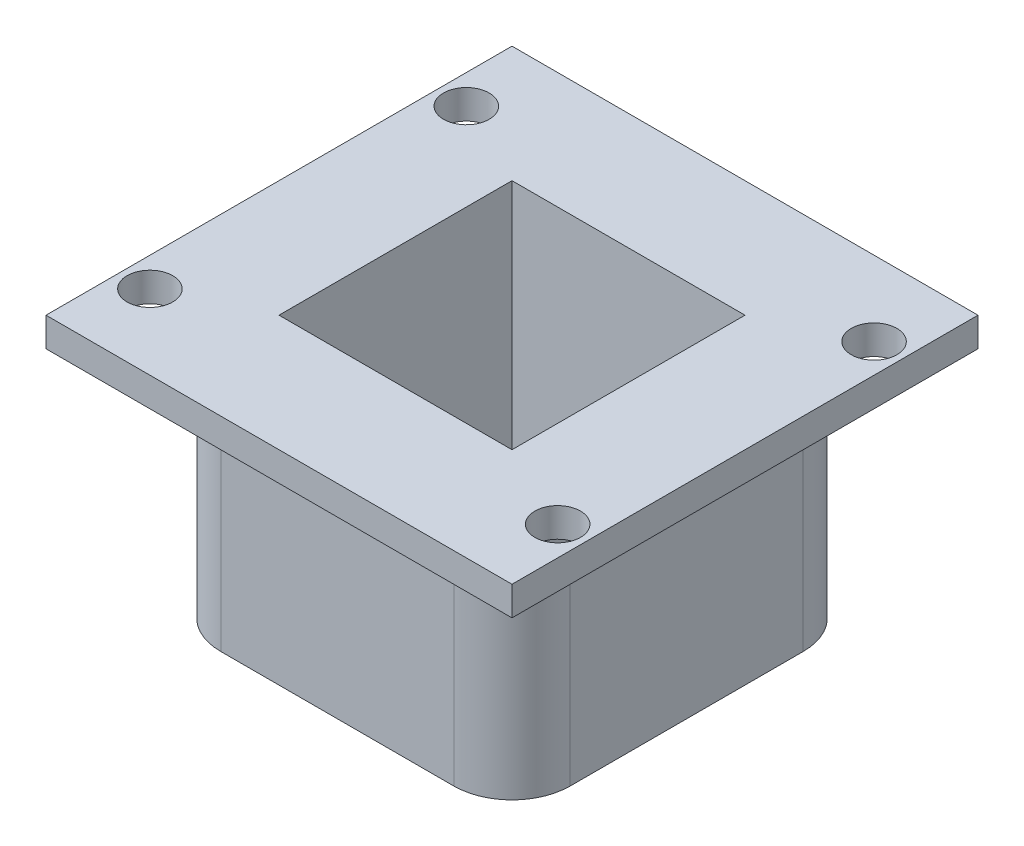
ISO-10303-21;
HEADER;
FILE_DESCRIPTION(('STEP AP214'),'2;1');
FILE_NAME('part.step','',(''),(''),'','','');
FILE_SCHEMA(('AUTOMOTIVE_DESIGN { 1 0 10303 214 1 1 1 1 }'));
ENDSEC;
DATA;
#1=APPLICATION_CONTEXT('core data for automotive mechanical design processes');
#2=APPLICATION_PROTOCOL_DEFINITION('international standard','automotive_design',2000,#1);
#3=PRODUCT_CONTEXT('',#1,'mechanical');
#4=PRODUCT('Part','Part','',(#3));
#5=PRODUCT_RELATED_PRODUCT_CATEGORY('part','',(#4));
#6=PRODUCT_DEFINITION_FORMATION('','',#4);
#7=PRODUCT_DEFINITION_CONTEXT('part definition',#1,'design');
#8=PRODUCT_DEFINITION('design','',#6,#7);
#9=PRODUCT_DEFINITION_SHAPE('','',#8);
#10=(LENGTH_UNIT() NAMED_UNIT(*) SI_UNIT(.MILLI.,.METRE.));
#11=(NAMED_UNIT(*) PLANE_ANGLE_UNIT() SI_UNIT($,.RADIAN.));
#12=(NAMED_UNIT(*) SI_UNIT($,.STERADIAN.) SOLID_ANGLE_UNIT());
#13=UNCERTAINTY_MEASURE_WITH_UNIT(LENGTH_MEASURE(1.E-05),#10,'distance_accuracy_value','');
#14=(GEOMETRIC_REPRESENTATION_CONTEXT(3) GLOBAL_UNCERTAINTY_ASSIGNED_CONTEXT((#13)) GLOBAL_UNIT_ASSIGNED_CONTEXT((#10,
#11,#12)) REPRESENTATION_CONTEXT('',''));
#15=CARTESIAN_POINT('',(0.,0.,0.));
#16=DIRECTION('',(0.,0.,1.));
#17=DIRECTION('',(1.,0.,0.));
#18=AXIS2_PLACEMENT_3D('',#15,#16,#17);
#19=CARTESIAN_POINT('',(0.,0.,0.));
#20=DIRECTION('',(0.,1.,0.));
#21=DIRECTION('',(0.,0.,1.));
#22=AXIS2_PLACEMENT_3D('',#19,#20,#21);
#23=PLANE('',#22);
#24=CARTESIAN_POINT('',(-22.225,0.,17.2466));
#25=DIRECTION('',(0.,1.,0.));
#26=DIRECTION('',(0.,0.,1.));
#27=AXIS2_PLACEMENT_3D('',#24,#25,#26);
#28=CIRCLE('',#27,2.4892);
#29=CARTESIAN_POINT('',(-22.225,0.,19.7358));
#30=VERTEX_POINT('',#29);
#31=EDGE_CURVE('E252',#30,#30,#28,.F.);
#32=ORIENTED_EDGE('',*,*,#31,.F.);
#33=EDGE_LOOP('',(#32));
#34=FACE_BOUND('',#33,.T.);
#35=CARTESIAN_POINT('',(22.225,0.,17.2466));
#36=DIRECTION('',(0.,1.,0.));
#37=DIRECTION('',(0.,0.,1.));
#38=AXIS2_PLACEMENT_3D('',#35,#36,#37);
#39=CIRCLE('',#38,2.4892);
#40=CARTESIAN_POINT('',(22.225,0.,19.7358));
#41=VERTEX_POINT('',#40);
#42=EDGE_CURVE('E290',#41,#41,#39,.T.);
#43=ORIENTED_EDGE('',*,*,#42,.T.);
#44=EDGE_LOOP('',(#43));
#45=FACE_BOUND('',#44,.T.);
#46=DIRECTION('',(1.,0.,0.));
#47=VECTOR('',#46,1.);
#48=CARTESIAN_POINT('',(0.,0.,25.4));
#49=LINE('',#48,#47);
#50=CARTESIAN_POINT('',(-25.4,0.,25.4));
#51=VERTEX_POINT('',#50);
#52=CARTESIAN_POINT('',(25.4,0.,25.4));
#53=VERTEX_POINT('',#52);
#54=EDGE_CURVE('E278',#51,#53,#49,.T.);
#55=ORIENTED_EDGE('',*,*,#54,.F.);
#56=DIRECTION('',(0.,0.,-1.));
#57=VECTOR('',#56,1.);
#58=CARTESIAN_POINT('',(-25.4,0.,0.));
#59=LINE('',#58,#57);
#60=CARTESIAN_POINT('',(-25.4,0.,-25.4));
#61=VERTEX_POINT('',#60);
#62=EDGE_CURVE('E287',#51,#61,#59,.T.);
#63=ORIENTED_EDGE('',*,*,#62,.T.);
#64=DIRECTION('',(1.,0.,0.));
#65=VECTOR('',#64,1.);
#66=CARTESIAN_POINT('',(0.,0.,-25.4));
#67=LINE('',#66,#65);
#68=CARTESIAN_POINT('',(25.4,0.,-25.4));
#69=VERTEX_POINT('',#68);
#70=EDGE_CURVE('E284',#61,#69,#67,.T.);
#71=ORIENTED_EDGE('',*,*,#70,.T.);
#72=DIRECTION('',(0.,0.,-1.));
#73=VECTOR('',#72,1.);
#74=CARTESIAN_POINT('',(25.4,0.,0.));
#75=LINE('',#74,#73);
#76=EDGE_CURVE('E281',#53,#69,#75,.T.);
#77=ORIENTED_EDGE('',*,*,#76,.F.);
#78=EDGE_LOOP('',(#55,#63,#71,#77));
#79=FACE_BOUND('',#78,.T.);
#80=CARTESIAN_POINT('',(-22.225,0.,-17.2466));
#81=DIRECTION('',(0.,1.,0.));
#82=DIRECTION('',(0.,0.,1.));
#83=AXIS2_PLACEMENT_3D('',#80,#81,#82);
#84=CIRCLE('',#83,2.4892);
#85=CARTESIAN_POINT('',(-22.225,0.,-14.7574));
#86=VERTEX_POINT('',#85);
#87=EDGE_CURVE('E275',#86,#86,#84,.T.);
#88=ORIENTED_EDGE('',*,*,#87,.T.);
#89=EDGE_LOOP('',(#88));
#90=FACE_BOUND('',#89,.T.);
#91=CARTESIAN_POINT('',(22.225,0.,-17.2466));
#92=DIRECTION('',(0.,1.,0.));
#93=DIRECTION('',(0.,0.,1.));
#94=AXIS2_PLACEMENT_3D('',#91,#92,#93);
#95=CIRCLE('',#94,2.4892);
#96=CARTESIAN_POINT('',(22.225,0.,-14.7574));
#97=VERTEX_POINT('',#96);
#98=EDGE_CURVE('E230',#97,#97,#95,.F.);
#99=ORIENTED_EDGE('',*,*,#98,.F.);
#100=EDGE_LOOP('',(#99));
#101=FACE_BOUND('',#100,.T.);
#102=CARTESIAN_POINT('',(-12.6999999999987,0.,12.7));
#103=DIRECTION('',(0.,1.,0.));
#104=DIRECTION('',(0.,0.,1.));
#105=AXIS2_PLACEMENT_3D('',#102,#103,#104);
#106=CIRCLE('',#105,6.35);
#107=CARTESIAN_POINT('',(-12.6999999999987,0.,19.05));
#108=VERTEX_POINT('',#107);
#109=CARTESIAN_POINT('',(-19.05,0.,12.7));
#110=VERTEX_POINT('',#109);
#111=EDGE_CURVE('E185',#108,#110,#106,.F.);
#112=ORIENTED_EDGE('',*,*,#111,.F.);
#113=DIRECTION('',(1.,0.,0.));
#114=VECTOR('',#113,1.);
#115=CARTESIAN_POINT('',(0.,0.,19.05));
#116=LINE('',#115,#114);
#117=CARTESIAN_POINT('',(12.7000000000013,0.,19.05));
#118=VERTEX_POINT('',#117);
#119=EDGE_CURVE('E212',#108,#118,#116,.T.);
#120=ORIENTED_EDGE('',*,*,#119,.T.);
#121=CARTESIAN_POINT('',(12.7000000000013,0.,12.6999999999987));
#122=DIRECTION('',(0.,1.,0.));
#123=DIRECTION('',(0.,0.,1.));
#124=AXIS2_PLACEMENT_3D('',#121,#122,#123);
#125=CIRCLE('',#124,6.35);
#126=CARTESIAN_POINT('',(19.05,0.,12.6999999999987));
#127=VERTEX_POINT('',#126);
#128=EDGE_CURVE('E215',#127,#118,#125,.F.);
#129=ORIENTED_EDGE('',*,*,#128,.F.);
#130=DIRECTION('',(0.,0.,-1.));
#131=VECTOR('',#130,1.);
#132=CARTESIAN_POINT('',(19.05,0.,0.));
#133=LINE('',#132,#131);
#134=CARTESIAN_POINT('',(19.05,0.,-12.7000000000013));
#135=VERTEX_POINT('',#134);
#136=EDGE_CURVE('E217',#127,#135,#133,.T.);
#137=ORIENTED_EDGE('',*,*,#136,.T.);
#138=CARTESIAN_POINT('',(12.7,0.,-12.7000000000013));
#139=DIRECTION('',(0.,1.,0.));
#140=DIRECTION('',(0.,0.,1.));
#141=AXIS2_PLACEMENT_3D('',#138,#139,#140);
#142=CIRCLE('',#141,6.35);
#143=CARTESIAN_POINT('',(12.7,0.,-19.05));
#144=VERTEX_POINT('',#143);
#145=EDGE_CURVE('E220',#144,#135,#142,.F.);
#146=ORIENTED_EDGE('',*,*,#145,.F.);
#147=DIRECTION('',(1.,0.,0.));
#148=VECTOR('',#147,1.);
#149=CARTESIAN_POINT('',(0.,0.,-19.05));
#150=LINE('',#149,#148);
#151=CARTESIAN_POINT('',(-12.7,0.,-19.05));
#152=VERTEX_POINT('',#151);
#153=EDGE_CURVE('E223',#152,#144,#150,.T.);
#154=ORIENTED_EDGE('',*,*,#153,.F.);
#155=CARTESIAN_POINT('',(-12.7,0.,-12.7));
#156=DIRECTION('',(0.,1.,0.));
#157=DIRECTION('',(0.,0.,1.));
#158=AXIS2_PLACEMENT_3D('',#155,#156,#157);
#159=CIRCLE('',#158,6.35);
#160=CARTESIAN_POINT('',(-19.05,0.,-12.7));
#161=VERTEX_POINT('',#160);
#162=EDGE_CURVE('E225',#161,#152,#159,.F.);
#163=ORIENTED_EDGE('',*,*,#162,.F.);
#164=DIRECTION('',(0.,0.,-1.));
#165=VECTOR('',#164,1.);
#166=CARTESIAN_POINT('',(-19.05,0.,0.));
#167=LINE('',#166,#165);
#168=EDGE_CURVE('E193',#110,#161,#167,.T.);
#169=ORIENTED_EDGE('',*,*,#168,.F.);
#170=EDGE_LOOP('',(#112,#120,#129,#137,#146,#154,#163,#169));
#171=FACE_BOUND('',#170,.T.);
#172=ADVANCED_FACE('F39',(#34,#45,#79,#90,#101,#171),#23,.F.);
#173=CARTESIAN_POINT('',(0.,3.175,25.4));
#174=DIRECTION('',(0.,0.,-1.));
#175=DIRECTION('',(-1.,0.,0.));
#176=AXIS2_PLACEMENT_3D('',#173,#174,#175);
#177=PLANE('',#176);
#178=ORIENTED_EDGE('',*,*,#54,.T.);
#179=DIRECTION('',(0.,-1.,0.));
#180=VECTOR('',#179,1.);
#181=CARTESIAN_POINT('',(25.4,3.175,25.4));
#182=LINE('',#181,#180);
#183=CARTESIAN_POINT('',(25.4,3.175,25.4));
#184=VERTEX_POINT('',#183);
#185=EDGE_CURVE('E11',#184,#53,#182,.T.);
#186=ORIENTED_EDGE('',*,*,#185,.F.);
#187=DIRECTION('',(1.,0.,0.));
#188=VECTOR('',#187,1.);
#189=CARTESIAN_POINT('',(0.,3.175,25.4));
#190=LINE('',#189,#188);
#191=CARTESIAN_POINT('',(-25.4,3.175,25.4));
#192=VERTEX_POINT('',#191);
#193=EDGE_CURVE('E255',#192,#184,#190,.T.);
#194=ORIENTED_EDGE('',*,*,#193,.F.);
#195=DIRECTION('',(0.,-1.,0.));
#196=VECTOR('',#195,1.);
#197=CARTESIAN_POINT('',(-25.4,3.175,25.4));
#198=LINE('',#197,#196);
#199=EDGE_CURVE('E272',#192,#51,#198,.T.);
#200=ORIENTED_EDGE('',*,*,#199,.T.);
#201=EDGE_LOOP('',(#178,#186,#194,#200));
#202=FACE_BOUND('',#201,.T.);
#203=ADVANCED_FACE('F317',(#202),#177,.F.);
#204=CARTESIAN_POINT('',(25.4,3.175,0.));
#205=DIRECTION('',(-1.,0.,0.));
#206=DIRECTION('',(0.,0.,1.));
#207=AXIS2_PLACEMENT_3D('',#204,#205,#206);
#208=PLANE('',#207);
#209=ORIENTED_EDGE('',*,*,#76,.T.);
#210=DIRECTION('',(0.,-1.,0.));
#211=VECTOR('',#210,1.);
#212=CARTESIAN_POINT('',(25.4,3.175,-25.4));
#213=LINE('',#212,#211);
#214=CARTESIAN_POINT('',(25.4,3.175,-25.4));
#215=VERTEX_POINT('',#214);
#216=EDGE_CURVE('E47',#215,#69,#213,.T.);
#217=ORIENTED_EDGE('',*,*,#216,.F.);
#218=DIRECTION('',(0.,0.,-1.));
#219=VECTOR('',#218,1.);
#220=CARTESIAN_POINT('',(25.4,3.175,0.));
#221=LINE('',#220,#219);
#222=EDGE_CURVE('E258',#184,#215,#221,.T.);
#223=ORIENTED_EDGE('',*,*,#222,.F.);
#224=ORIENTED_EDGE('',*,*,#185,.T.);
#225=EDGE_LOOP('',(#209,#217,#223,#224));
#226=FACE_BOUND('',#225,.T.);
#227=ADVANCED_FACE('F303',(#226),#208,.F.);
#228=CARTESIAN_POINT('',(0.,3.175,-25.4));
#229=DIRECTION('',(0.,0.,-1.));
#230=DIRECTION('',(-1.,0.,0.));
#231=AXIS2_PLACEMENT_3D('',#228,#229,#230);
#232=PLANE('',#231);
#233=ORIENTED_EDGE('',*,*,#70,.F.);
#234=DIRECTION('',(0.,-1.,0.));
#235=VECTOR('',#234,1.);
#236=CARTESIAN_POINT('',(-25.4,3.175,-25.4));
#237=LINE('',#236,#235);
#238=CARTESIAN_POINT('',(-25.4,3.175,-25.4));
#239=VERTEX_POINT('',#238);
#240=EDGE_CURVE('E296',#239,#61,#237,.T.);
#241=ORIENTED_EDGE('',*,*,#240,.F.);
#242=DIRECTION('',(1.,0.,0.));
#243=VECTOR('',#242,1.);
#244=CARTESIAN_POINT('',(0.,3.175,-25.4));
#245=LINE('',#244,#243);
#246=EDGE_CURVE('E260',#239,#215,#245,.T.);
#247=ORIENTED_EDGE('',*,*,#246,.T.);
#248=ORIENTED_EDGE('',*,*,#216,.T.);
#249=EDGE_LOOP('',(#233,#241,#247,#248));
#250=FACE_BOUND('',#249,.T.);
#251=ADVANCED_FACE('F300',(#250),#232,.T.);
#252=CARTESIAN_POINT('',(22.225,3.175,17.2466));
#253=DIRECTION('',(0.,-1.,0.));
#254=DIRECTION('',(0.,0.,-1.));
#255=AXIS2_PLACEMENT_3D('',#252,#253,#254);
#256=CYLINDRICAL_SURFACE('',#255,2.4892);
#257=CARTESIAN_POINT('',(22.225,3.175,17.2466));
#258=DIRECTION('',(0.,1.,0.));
#259=DIRECTION('',(0.,0.,1.));
#260=AXIS2_PLACEMENT_3D('',#257,#258,#259);
#261=CIRCLE('',#260,2.4892);
#262=CARTESIAN_POINT('',(22.225,3.175,19.7358));
#263=VERTEX_POINT('',#262);
#264=EDGE_CURVE('E266',#263,#263,#261,.T.);
#265=ORIENTED_EDGE('',*,*,#264,.T.);
#266=EDGE_LOOP('',(#265));
#267=FACE_BOUND('',#266,.T.);
#268=ORIENTED_EDGE('',*,*,#42,.F.);
#269=EDGE_LOOP('',(#268));
#270=FACE_BOUND('',#269,.T.);
#271=ADVANCED_FACE('F337',(#267,#270),#256,.F.);
#272=CARTESIAN_POINT('',(-25.4,3.175,0.));
#273=DIRECTION('',(-1.,0.,0.));
#274=DIRECTION('',(0.,0.,1.));
#275=AXIS2_PLACEMENT_3D('',#272,#273,#274);
#276=PLANE('',#275);
#277=ORIENTED_EDGE('',*,*,#62,.F.);
#278=ORIENTED_EDGE('',*,*,#199,.F.);
#279=DIRECTION('',(0.,0.,-1.));
#280=VECTOR('',#279,1.);
#281=CARTESIAN_POINT('',(-25.4,3.175,0.));
#282=LINE('',#281,#280);
#283=EDGE_CURVE('E263',#192,#239,#282,.T.);
#284=ORIENTED_EDGE('',*,*,#283,.T.);
#285=ORIENTED_EDGE('',*,*,#240,.T.);
#286=EDGE_LOOP('',(#277,#278,#284,#285));
#287=FACE_BOUND('',#286,.T.);
#288=ADVANCED_FACE('F310',(#287),#276,.T.);
#289=CARTESIAN_POINT('',(-22.225,3.175,-17.2466));
#290=DIRECTION('',(0.,-1.,0.));
#291=DIRECTION('',(0.,0.,-1.));
#292=AXIS2_PLACEMENT_3D('',#289,#290,#291);
#293=CYLINDRICAL_SURFACE('',#292,2.4892);
#294=CARTESIAN_POINT('',(-22.225,3.175,-17.2466));
#295=DIRECTION('',(0.,1.,0.));
#296=DIRECTION('',(0.,0.,1.));
#297=AXIS2_PLACEMENT_3D('',#294,#295,#296);
#298=CIRCLE('',#297,2.4892);
#299=CARTESIAN_POINT('',(-22.225,3.175,-14.7574));
#300=VERTEX_POINT('',#299);
#301=EDGE_CURVE('E251',#300,#300,#298,.T.);
#302=ORIENTED_EDGE('',*,*,#301,.T.);
#303=EDGE_LOOP('',(#302));
#304=FACE_BOUND('',#303,.T.);
#305=ORIENTED_EDGE('',*,*,#87,.F.);
#306=EDGE_LOOP('',(#305));
#307=FACE_BOUND('',#306,.T.);
#308=ADVANCED_FACE('F328',(#304,#307),#293,.F.);
#309=CARTESIAN_POINT('',(22.225,3.175,-17.2466));
#310=DIRECTION('',(0.,-1.,0.));
#311=DIRECTION('',(0.,0.,-1.));
#312=AXIS2_PLACEMENT_3D('',#309,#310,#311);
#313=CYLINDRICAL_SURFACE('',#312,2.4892);
#314=CARTESIAN_POINT('',(22.225,3.175,-17.2466));
#315=DIRECTION('',(0.,1.,0.));
#316=DIRECTION('',(0.,0.,1.));
#317=AXIS2_PLACEMENT_3D('',#314,#315,#316);
#318=CIRCLE('',#317,2.4892);
#319=CARTESIAN_POINT('',(22.225,3.175,-14.7574));
#320=VERTEX_POINT('',#319);
#321=EDGE_CURVE('E248',#320,#320,#318,.F.);
#322=ORIENTED_EDGE('',*,*,#321,.F.);
#323=EDGE_LOOP('',(#322));
#324=FACE_BOUND('',#323,.T.);
#325=ORIENTED_EDGE('',*,*,#98,.T.);
#326=EDGE_LOOP('',(#325));
#327=FACE_BOUND('',#326,.T.);
#328=ADVANCED_FACE('F41',(#324,#327),#313,.F.);
#329=CARTESIAN_POINT('',(-22.225,3.175,17.2466));
#330=DIRECTION('',(0.,-1.,0.));
#331=DIRECTION('',(0.,0.,-1.));
#332=AXIS2_PLACEMENT_3D('',#329,#330,#331);
#333=CYLINDRICAL_SURFACE('',#332,2.4892);
#334=CARTESIAN_POINT('',(-22.225,3.175,17.2466));
#335=DIRECTION('',(0.,1.,0.));
#336=DIRECTION('',(0.,0.,1.));
#337=AXIS2_PLACEMENT_3D('',#334,#335,#336);
#338=CIRCLE('',#337,2.4892);
#339=CARTESIAN_POINT('',(-22.225,3.175,19.7358));
#340=VERTEX_POINT('',#339);
#341=EDGE_CURVE('E269',#340,#340,#338,.F.);
#342=ORIENTED_EDGE('',*,*,#341,.F.);
#343=EDGE_LOOP('',(#342));
#344=FACE_BOUND('',#343,.T.);
#345=ORIENTED_EDGE('',*,*,#31,.T.);
#346=EDGE_LOOP('',(#345));
#347=FACE_BOUND('',#346,.T.);
#348=ADVANCED_FACE('F335',(#344,#347),#333,.F.);
#349=CARTESIAN_POINT('',(0.,3.175,0.));
#350=DIRECTION('',(0.,1.,0.));
#351=DIRECTION('',(0.,0.,1.));
#352=AXIS2_PLACEMENT_3D('',#349,#350,#351);
#353=PLANE('',#352);
#354=DIRECTION('',(0.,0.,-1.));
#355=VECTOR('',#354,1.);
#356=CARTESIAN_POINT('',(12.7,3.175,12.7));
#357=LINE('',#356,#355);
#358=CARTESIAN_POINT('',(12.7,3.175,12.7));
#359=VERTEX_POINT('',#358);
#360=CARTESIAN_POINT('',(12.7,3.175,-12.7));
#361=VERTEX_POINT('',#360);
#362=EDGE_CURVE('E54',#359,#361,#357,.T.);
#363=ORIENTED_EDGE('',*,*,#362,.F.);
#364=DIRECTION('',(1.,0.,0.));
#365=VECTOR('',#364,1.);
#366=CARTESIAN_POINT('',(-12.7,3.175,12.7));
#367=LINE('',#366,#365);
#368=CARTESIAN_POINT('',(-12.7,3.175,12.7));
#369=VERTEX_POINT('',#368);
#370=EDGE_CURVE('E170',#369,#359,#367,.T.);
#371=ORIENTED_EDGE('',*,*,#370,.F.);
#372=DIRECTION('',(0.,0.,1.));
#373=VECTOR('',#372,1.);
#374=CARTESIAN_POINT('',(-12.7,3.175,12.7));
#375=LINE('',#374,#373);
#376=CARTESIAN_POINT('',(-12.7,3.175,-12.7));
#377=VERTEX_POINT('',#376);
#378=EDGE_CURVE('E173',#377,#369,#375,.T.);
#379=ORIENTED_EDGE('',*,*,#378,.F.);
#380=DIRECTION('',(-1.,0.,0.));
#381=VECTOR('',#380,1.);
#382=CARTESIAN_POINT('',(-12.7,3.175,-12.7));
#383=LINE('',#382,#381);
#384=EDGE_CURVE('E179',#361,#377,#383,.T.);
#385=ORIENTED_EDGE('',*,*,#384,.F.);
#386=EDGE_LOOP('',(#363,#371,#379,#385));
#387=FACE_BOUND('',#386,.T.);
#388=ORIENTED_EDGE('',*,*,#321,.T.);
#389=EDGE_LOOP('',(#388));
#390=FACE_BOUND('',#389,.T.);
#391=ORIENTED_EDGE('',*,*,#301,.F.);
#392=EDGE_LOOP('',(#391));
#393=FACE_BOUND('',#392,.T.);
#394=ORIENTED_EDGE('',*,*,#193,.T.);
#395=ORIENTED_EDGE('',*,*,#222,.T.);
#396=ORIENTED_EDGE('',*,*,#246,.F.);
#397=ORIENTED_EDGE('',*,*,#283,.F.);
#398=EDGE_LOOP('',(#394,#395,#396,#397));
#399=FACE_BOUND('',#398,.T.);
#400=ORIENTED_EDGE('',*,*,#264,.F.);
#401=EDGE_LOOP('',(#400));
#402=FACE_BOUND('',#401,.T.);
#403=ORIENTED_EDGE('',*,*,#341,.T.);
#404=EDGE_LOOP('',(#403));
#405=FACE_BOUND('',#404,.T.);
#406=ADVANCED_FACE('F314',(#387,#390,#393,#399,#402,#405),#353,.T.);
#407=CARTESIAN_POINT('',(-12.6999999999987,-25.4,12.7));
#408=DIRECTION('',(0.,1.,0.));
#409=DIRECTION('',(0.,0.,1.));
#410=AXIS2_PLACEMENT_3D('',#407,#408,#409);
#411=CYLINDRICAL_SURFACE('',#410,6.35);
#412=ORIENTED_EDGE('',*,*,#111,.T.);
#413=DIRECTION('',(0.,1.,0.));
#414=VECTOR('',#413,1.);
#415=CARTESIAN_POINT('',(-19.05,-25.4,12.7));
#416=LINE('',#415,#414);
#417=CARTESIAN_POINT('',(-19.05,-25.4,12.7));
#418=VERTEX_POINT('',#417);
#419=EDGE_CURVE('E228',#418,#110,#416,.T.);
#420=ORIENTED_EDGE('',*,*,#419,.F.);
#421=CARTESIAN_POINT('',(-12.6999999999987,-25.4,12.7));
#422=DIRECTION('',(0.,1.,0.));
#423=DIRECTION('',(0.,0.,1.));
#424=AXIS2_PLACEMENT_3D('',#421,#422,#423);
#425=CIRCLE('',#424,6.35);
#426=CARTESIAN_POINT('',(-12.6999999999987,-25.4,19.05));
#427=VERTEX_POINT('',#426);
#428=EDGE_CURVE('E189',#427,#418,#425,.F.);
#429=ORIENTED_EDGE('',*,*,#428,.F.);
#430=DIRECTION('',(0.,1.,0.));
#431=VECTOR('',#430,1.);
#432=CARTESIAN_POINT('',(-12.6999999999987,-25.4,19.05));
#433=LINE('',#432,#431);
#434=EDGE_CURVE('E209',#427,#108,#433,.T.);
#435=ORIENTED_EDGE('',*,*,#434,.T.);
#436=EDGE_LOOP('',(#412,#420,#429,#435));
#437=FACE_BOUND('',#436,.T.);
#438=ADVANCED_FACE('F352',(#437),#411,.T.);
#439=CARTESIAN_POINT('',(-19.05,-25.4,0.));
#440=DIRECTION('',(1.,0.,0.));
#441=DIRECTION('',(0.,0.,-1.));
#442=AXIS2_PLACEMENT_3D('',#439,#440,#441);
#443=PLANE('',#442);
#444=ORIENTED_EDGE('',*,*,#168,.T.);
#445=DIRECTION('',(0.,1.,0.));
#446=VECTOR('',#445,1.);
#447=CARTESIAN_POINT('',(-19.05,-25.4,-12.7));
#448=LINE('',#447,#446);
#449=CARTESIAN_POINT('',(-19.05,-25.4,-12.7));
#450=VERTEX_POINT('',#449);
#451=EDGE_CURVE('E231',#450,#161,#448,.T.);
#452=ORIENTED_EDGE('',*,*,#451,.F.);
#453=DIRECTION('',(0.,0.,-1.));
#454=VECTOR('',#453,1.);
#455=CARTESIAN_POINT('',(-19.05,-25.4,0.));
#456=LINE('',#455,#454);
#457=EDGE_CURVE('E207',#418,#450,#456,.T.);
#458=ORIENTED_EDGE('',*,*,#457,.F.);
#459=ORIENTED_EDGE('',*,*,#419,.T.);
#460=EDGE_LOOP('',(#444,#452,#458,#459));
#461=FACE_BOUND('',#460,.T.);
#462=ADVANCED_FACE('F381',(#461),#443,.F.);
#463=CARTESIAN_POINT('',(-12.7,-25.4,-12.7));
#464=DIRECTION('',(0.,1.,0.));
#465=DIRECTION('',(0.,0.,1.));
#466=AXIS2_PLACEMENT_3D('',#463,#464,#465);
#467=CYLINDRICAL_SURFACE('',#466,6.35);
#468=ORIENTED_EDGE('',*,*,#162,.T.);
#469=DIRECTION('',(0.,1.,0.));
#470=VECTOR('',#469,1.);
#471=CARTESIAN_POINT('',(-12.7,-25.4,-19.05));
#472=LINE('',#471,#470);
#473=CARTESIAN_POINT('',(-12.7,-25.4,-19.05));
#474=VERTEX_POINT('',#473);
#475=EDGE_CURVE('E234',#474,#152,#472,.T.);
#476=ORIENTED_EDGE('',*,*,#475,.F.);
#477=CARTESIAN_POINT('',(-12.7,-25.4,-12.7));
#478=DIRECTION('',(0.,1.,0.));
#479=DIRECTION('',(0.,0.,1.));
#480=AXIS2_PLACEMENT_3D('',#477,#478,#479);
#481=CIRCLE('',#480,6.35);
#482=EDGE_CURVE('E205',#450,#474,#481,.F.);
#483=ORIENTED_EDGE('',*,*,#482,.F.);
#484=ORIENTED_EDGE('',*,*,#451,.T.);
#485=EDGE_LOOP('',(#468,#476,#483,#484));
#486=FACE_BOUND('',#485,.T.);
#487=ADVANCED_FACE('F377',(#486),#467,.T.);
#488=CARTESIAN_POINT('',(0.,-25.4,-19.05));
#489=DIRECTION('',(0.,0.,1.));
#490=DIRECTION('',(1.,0.,0.));
#491=AXIS2_PLACEMENT_3D('',#488,#489,#490);
#492=PLANE('',#491);
#493=ORIENTED_EDGE('',*,*,#153,.T.);
#494=DIRECTION('',(0.,1.,0.));
#495=VECTOR('',#494,1.);
#496=CARTESIAN_POINT('',(12.7,-25.4,-19.05));
#497=LINE('',#496,#495);
#498=CARTESIAN_POINT('',(12.7,-25.4,-19.05));
#499=VERTEX_POINT('',#498);
#500=EDGE_CURVE('E237',#499,#144,#497,.T.);
#501=ORIENTED_EDGE('',*,*,#500,.F.);
#502=DIRECTION('',(1.,0.,0.));
#503=VECTOR('',#502,1.);
#504=CARTESIAN_POINT('',(0.,-25.4,-19.05));
#505=LINE('',#504,#503);
#506=EDGE_CURVE('E203',#474,#499,#505,.T.);
#507=ORIENTED_EDGE('',*,*,#506,.F.);
#508=ORIENTED_EDGE('',*,*,#475,.T.);
#509=EDGE_LOOP('',(#493,#501,#507,#508));
#510=FACE_BOUND('',#509,.T.);
#511=ADVANCED_FACE('F374',(#510),#492,.F.);
#512=CARTESIAN_POINT('',(12.7,-25.4,-12.7000000000013));
#513=DIRECTION('',(0.,1.,0.));
#514=DIRECTION('',(0.,0.,1.));
#515=AXIS2_PLACEMENT_3D('',#512,#513,#514);
#516=CYLINDRICAL_SURFACE('',#515,6.35);
#517=ORIENTED_EDGE('',*,*,#145,.T.);
#518=DIRECTION('',(0.,1.,0.));
#519=VECTOR('',#518,1.);
#520=CARTESIAN_POINT('',(19.05,-25.4,-12.7000000000013));
#521=LINE('',#520,#519);
#522=CARTESIAN_POINT('',(19.05,-25.4,-12.7000000000013));
#523=VERTEX_POINT('',#522);
#524=EDGE_CURVE('E240',#523,#135,#521,.T.);
#525=ORIENTED_EDGE('',*,*,#524,.F.);
#526=CARTESIAN_POINT('',(12.7,-25.4,-12.7000000000013));
#527=DIRECTION('',(0.,1.,0.));
#528=DIRECTION('',(0.,0.,1.));
#529=AXIS2_PLACEMENT_3D('',#526,#527,#528);
#530=CIRCLE('',#529,6.35);
#531=EDGE_CURVE('E201',#499,#523,#530,.F.);
#532=ORIENTED_EDGE('',*,*,#531,.F.);
#533=ORIENTED_EDGE('',*,*,#500,.T.);
#534=EDGE_LOOP('',(#517,#525,#532,#533));
#535=FACE_BOUND('',#534,.T.);
#536=ADVANCED_FACE('F370',(#535),#516,.T.);
#537=CARTESIAN_POINT('',(19.05,-25.4,0.));
#538=DIRECTION('',(1.,0.,0.));
#539=DIRECTION('',(0.,0.,-1.));
#540=AXIS2_PLACEMENT_3D('',#537,#538,#539);
#541=PLANE('',#540);
#542=ORIENTED_EDGE('',*,*,#136,.F.);
#543=DIRECTION('',(0.,1.,0.));
#544=VECTOR('',#543,1.);
#545=CARTESIAN_POINT('',(19.05,-25.4,12.6999999999987));
#546=LINE('',#545,#544);
#547=CARTESIAN_POINT('',(19.05,-25.4,12.6999999999987));
#548=VERTEX_POINT('',#547);
#549=EDGE_CURVE('E242',#548,#127,#546,.T.);
#550=ORIENTED_EDGE('',*,*,#549,.F.);
#551=DIRECTION('',(0.,0.,-1.));
#552=VECTOR('',#551,1.);
#553=CARTESIAN_POINT('',(19.05,-25.4,0.));
#554=LINE('',#553,#552);
#555=EDGE_CURVE('E198',#548,#523,#554,.T.);
#556=ORIENTED_EDGE('',*,*,#555,.T.);
#557=ORIENTED_EDGE('',*,*,#524,.T.);
#558=EDGE_LOOP('',(#542,#550,#556,#557));
#559=FACE_BOUND('',#558,.T.);
#560=ADVANCED_FACE('F366',(#559),#541,.T.);
#561=CARTESIAN_POINT('',(12.7000000000013,-25.4,12.6999999999987));
#562=DIRECTION('',(0.,1.,0.));
#563=DIRECTION('',(0.,0.,1.));
#564=AXIS2_PLACEMENT_3D('',#561,#562,#563);
#565=CYLINDRICAL_SURFACE('',#564,6.35);
#566=ORIENTED_EDGE('',*,*,#128,.T.);
#567=DIRECTION('',(0.,1.,0.));
#568=VECTOR('',#567,1.);
#569=CARTESIAN_POINT('',(12.7000000000013,-25.4,19.05));
#570=LINE('',#569,#568);
#571=CARTESIAN_POINT('',(12.7000000000013,-25.4,19.05));
#572=VERTEX_POINT('',#571);
#573=EDGE_CURVE('E244',#572,#118,#570,.T.);
#574=ORIENTED_EDGE('',*,*,#573,.F.);
#575=CARTESIAN_POINT('',(12.7000000000013,-25.4,12.6999999999987));
#576=DIRECTION('',(0.,1.,0.));
#577=DIRECTION('',(0.,0.,1.));
#578=AXIS2_PLACEMENT_3D('',#575,#576,#577);
#579=CIRCLE('',#578,6.35);
#580=EDGE_CURVE('E196',#548,#572,#579,.F.);
#581=ORIENTED_EDGE('',*,*,#580,.F.);
#582=ORIENTED_EDGE('',*,*,#549,.T.);
#583=EDGE_LOOP('',(#566,#574,#581,#582));
#584=FACE_BOUND('',#583,.T.);
#585=ADVANCED_FACE('F360',(#584),#565,.T.);
#586=CARTESIAN_POINT('',(0.,-25.4,19.05));
#587=DIRECTION('',(0.,0.,1.));
#588=DIRECTION('',(1.,0.,0.));
#589=AXIS2_PLACEMENT_3D('',#586,#587,#588);
#590=PLANE('',#589);
#591=ORIENTED_EDGE('',*,*,#119,.F.);
#592=ORIENTED_EDGE('',*,*,#434,.F.);
#593=DIRECTION('',(1.,0.,0.));
#594=VECTOR('',#593,1.);
#595=CARTESIAN_POINT('',(0.,-25.4,19.05));
#596=LINE('',#595,#594);
#597=EDGE_CURVE('E192',#427,#572,#596,.T.);
#598=ORIENTED_EDGE('',*,*,#597,.T.);
#599=ORIENTED_EDGE('',*,*,#573,.T.);
#600=EDGE_LOOP('',(#591,#592,#598,#599));
#601=FACE_BOUND('',#600,.T.);
#602=ADVANCED_FACE('F356',(#601),#590,.T.);
#603=CARTESIAN_POINT('',(0.,-25.4,0.));
#604=DIRECTION('',(0.,1.,0.));
#605=DIRECTION('',(0.,0.,1.));
#606=AXIS2_PLACEMENT_3D('',#603,#604,#605);
#607=PLANE('',#606);
#608=DIRECTION('',(1.,0.,0.));
#609=VECTOR('',#608,1.);
#610=CARTESIAN_POINT('',(-12.7,-25.4,12.7));
#611=LINE('',#610,#609);
#612=CARTESIAN_POINT('',(-12.7,-25.4,12.7));
#613=VERTEX_POINT('',#612);
#614=CARTESIAN_POINT('',(12.7,-25.4,12.7));
#615=VERTEX_POINT('',#614);
#616=EDGE_CURVE('E160',#613,#615,#611,.T.);
#617=ORIENTED_EDGE('',*,*,#616,.T.);
#618=DIRECTION('',(0.,0.,-1.));
#619=VECTOR('',#618,1.);
#620=CARTESIAN_POINT('',(12.7,-25.4,12.7));
#621=LINE('',#620,#619);
#622=CARTESIAN_POINT('',(12.7,-25.4,-12.7));
#623=VERTEX_POINT('',#622);
#624=EDGE_CURVE('E154',#615,#623,#621,.T.);
#625=ORIENTED_EDGE('',*,*,#624,.T.);
#626=DIRECTION('',(-1.,0.,0.));
#627=VECTOR('',#626,1.);
#628=CARTESIAN_POINT('',(-12.7,-25.4,-12.7));
#629=LINE('',#628,#627);
#630=CARTESIAN_POINT('',(-12.7,-25.4,-12.7));
#631=VERTEX_POINT('',#630);
#632=EDGE_CURVE('E163',#623,#631,#629,.T.);
#633=ORIENTED_EDGE('',*,*,#632,.T.);
#634=DIRECTION('',(0.,0.,1.));
#635=VECTOR('',#634,1.);
#636=CARTESIAN_POINT('',(-12.7,-25.4,12.7));
#637=LINE('',#636,#635);
#638=EDGE_CURVE('E62',#631,#613,#637,.T.);
#639=ORIENTED_EDGE('',*,*,#638,.T.);
#640=EDGE_LOOP('',(#617,#625,#633,#639));
#641=FACE_BOUND('',#640,.T.);
#642=ORIENTED_EDGE('',*,*,#428,.T.);
#643=ORIENTED_EDGE('',*,*,#457,.T.);
#644=ORIENTED_EDGE('',*,*,#482,.T.);
#645=ORIENTED_EDGE('',*,*,#506,.T.);
#646=ORIENTED_EDGE('',*,*,#531,.T.);
#647=ORIENTED_EDGE('',*,*,#555,.F.);
#648=ORIENTED_EDGE('',*,*,#580,.T.);
#649=ORIENTED_EDGE('',*,*,#597,.F.);
#650=EDGE_LOOP('',(#642,#643,#644,#645,#646,#647,#648,#649));
#651=FACE_BOUND('',#650,.T.);
#652=ADVANCED_FACE('F167',(#641,#651),#607,.F.);
#653=CARTESIAN_POINT('',(12.7,-25.4,12.7));
#654=DIRECTION('',(1.,0.,0.));
#655=DIRECTION('',(0.,0.,-1.));
#656=AXIS2_PLACEMENT_3D('',#653,#654,#655);
#657=PLANE('',#656);
#658=ORIENTED_EDGE('',*,*,#362,.T.);
#659=DIRECTION('',(0.,1.,0.));
#660=VECTOR('',#659,1.);
#661=CARTESIAN_POINT('',(12.7,-25.4,-12.7));
#662=LINE('',#661,#660);
#663=EDGE_CURVE('E150',#623,#361,#662,.T.);
#664=ORIENTED_EDGE('',*,*,#663,.F.);
#665=ORIENTED_EDGE('',*,*,#624,.F.);
#666=DIRECTION('',(0.,1.,0.));
#667=VECTOR('',#666,1.);
#668=CARTESIAN_POINT('',(12.7,-25.4,12.7));
#669=LINE('',#668,#667);
#670=EDGE_CURVE('E183',#615,#359,#669,.T.);
#671=ORIENTED_EDGE('',*,*,#670,.T.);
#672=EDGE_LOOP('',(#658,#664,#665,#671));
#673=FACE_BOUND('',#672,.T.);
#674=ADVANCED_FACE('F152',(#673),#657,.F.);
#675=CARTESIAN_POINT('',(-12.7,-25.4,12.7));
#676=DIRECTION('',(0.,0.,1.));
#677=DIRECTION('',(1.,0.,0.));
#678=AXIS2_PLACEMENT_3D('',#675,#676,#677);
#679=PLANE('',#678);
#680=ORIENTED_EDGE('',*,*,#370,.T.);
#681=ORIENTED_EDGE('',*,*,#670,.F.);
#682=ORIENTED_EDGE('',*,*,#616,.F.);
#683=DIRECTION('',(0.,1.,0.));
#684=VECTOR('',#683,1.);
#685=CARTESIAN_POINT('',(-12.7,-25.4,12.7));
#686=LINE('',#685,#684);
#687=EDGE_CURVE('E186',#613,#369,#686,.T.);
#688=ORIENTED_EDGE('',*,*,#687,.T.);
#689=EDGE_LOOP('',(#680,#681,#682,#688));
#690=FACE_BOUND('',#689,.T.);
#691=ADVANCED_FACE('F388',(#690),#679,.F.);
#692=CARTESIAN_POINT('',(-12.7,-25.4,12.7));
#693=DIRECTION('',(-1.,0.,0.));
#694=DIRECTION('',(0.,0.,1.));
#695=AXIS2_PLACEMENT_3D('',#692,#693,#694);
#696=PLANE('',#695);
#697=ORIENTED_EDGE('',*,*,#378,.T.);
#698=ORIENTED_EDGE('',*,*,#687,.F.);
#699=ORIENTED_EDGE('',*,*,#638,.F.);
#700=DIRECTION('',(0.,1.,0.));
#701=VECTOR('',#700,1.);
#702=CARTESIAN_POINT('',(-12.7,-25.4,-12.7));
#703=LINE('',#702,#701);
#704=EDGE_CURVE('E159',#631,#377,#703,.T.);
#705=ORIENTED_EDGE('',*,*,#704,.T.);
#706=EDGE_LOOP('',(#697,#698,#699,#705));
#707=FACE_BOUND('',#706,.T.);
#708=ADVANCED_FACE('F523',(#707),#696,.F.);
#709=CARTESIAN_POINT('',(-12.7,-25.4,-12.7));
#710=DIRECTION('',(0.,0.,-1.));
#711=DIRECTION('',(-1.,0.,0.));
#712=AXIS2_PLACEMENT_3D('',#709,#710,#711);
#713=PLANE('',#712);
#714=ORIENTED_EDGE('',*,*,#384,.T.);
#715=ORIENTED_EDGE('',*,*,#704,.F.);
#716=ORIENTED_EDGE('',*,*,#632,.F.);
#717=ORIENTED_EDGE('',*,*,#663,.T.);
#718=EDGE_LOOP('',(#714,#715,#716,#717));
#719=FACE_BOUND('',#718,.T.);
#720=ADVANCED_FACE('F164',(#719),#713,.F.);
#721=CLOSED_SHELL('',(#172,#203,#227,#251,#271,#288,#308,#328,#348,#406,#438,#462,#487,#511,
#536,#560,#585,#602,#652,#674,#691,#708,#720));
#722=MANIFOLD_SOLID_BREP('B2',#721);
#723=ADVANCED_BREP_SHAPE_REPRESENTATION('',(#18,#722),#14);
#724=SHAPE_DEFINITION_REPRESENTATION(#9,#723);
ENDSEC;
END-ISO-10303-21;
